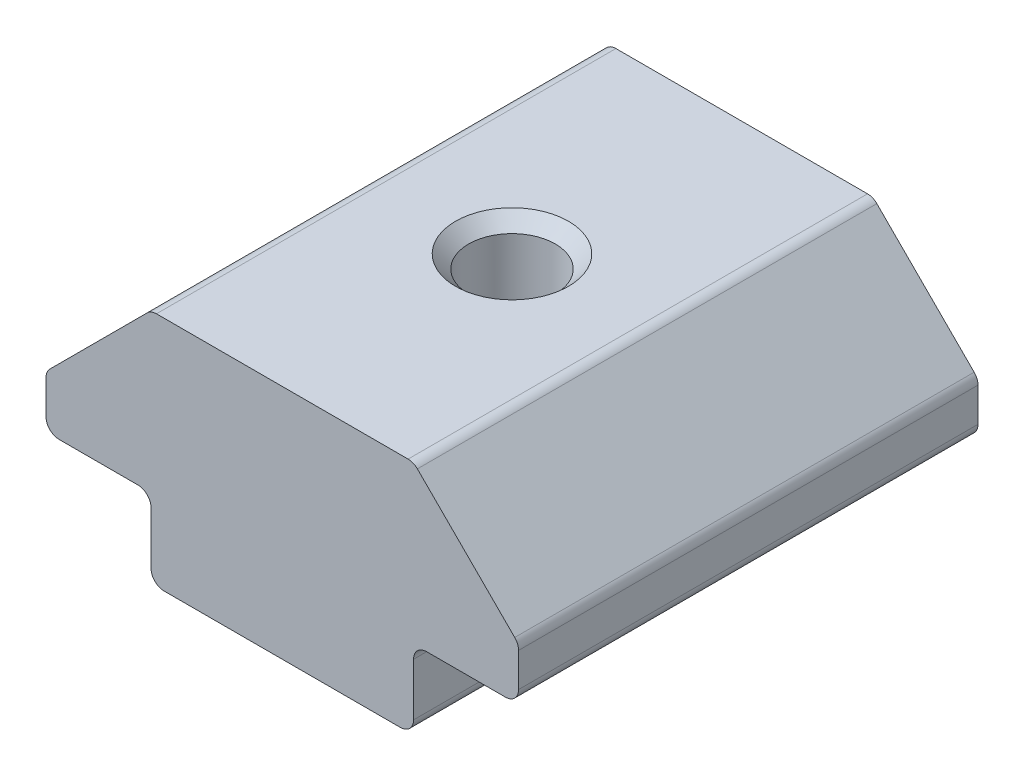
ISO-10303-21;
HEADER;
FILE_DESCRIPTION(('STEP AP214'),'2;1');
FILE_NAME('part.step','',(''),(''),'','','');
FILE_SCHEMA(('AUTOMOTIVE_DESIGN { 1 0 10303 214 1 1 1 1 }'));
ENDSEC;
DATA;
#1=APPLICATION_CONTEXT('core data for automotive mechanical design processes');
#2=APPLICATION_PROTOCOL_DEFINITION('international standard','automotive_design',2000,#1);
#3=PRODUCT_CONTEXT('',#1,'mechanical');
#4=PRODUCT('Part','Part','',(#3));
#5=PRODUCT_RELATED_PRODUCT_CATEGORY('part','',(#4));
#6=PRODUCT_DEFINITION_FORMATION('','',#4);
#7=PRODUCT_DEFINITION_CONTEXT('part definition',#1,'design');
#8=PRODUCT_DEFINITION('design','',#6,#7);
#9=PRODUCT_DEFINITION_SHAPE('','',#8);
#10=(LENGTH_UNIT() NAMED_UNIT(*) SI_UNIT(.MILLI.,.METRE.));
#11=(NAMED_UNIT(*) PLANE_ANGLE_UNIT() SI_UNIT($,.RADIAN.));
#12=(NAMED_UNIT(*) SI_UNIT($,.STERADIAN.) SOLID_ANGLE_UNIT());
#13=UNCERTAINTY_MEASURE_WITH_UNIT(LENGTH_MEASURE(1.E-05),#10,'distance_accuracy_value','');
#14=(GEOMETRIC_REPRESENTATION_CONTEXT(3) GLOBAL_UNCERTAINTY_ASSIGNED_CONTEXT((#13)) GLOBAL_UNIT_ASSIGNED_CONTEXT((#10,
#11,#12)) REPRESENTATION_CONTEXT('',''));
#15=CARTESIAN_POINT('',(0.,0.,0.));
#16=DIRECTION('',(0.,0.,1.));
#17=DIRECTION('',(1.,0.,0.));
#18=AXIS2_PLACEMENT_3D('',#15,#16,#17);
#19=CARTESIAN_POINT('',(-6.63715847617141,0.189784071231771,8.69764901970257));
#20=DIRECTION('',(1.,0.,0.));
#21=DIRECTION('',(0.,0.,-1.));
#22=AXIS2_PLACEMENT_3D('',#19,#20,#21);
#23=PLANE('',#22);
#24=DIRECTION('',(0.,-1.,0.));
#25=VECTOR('',#24,1.);
#26=CARTESIAN_POINT('',(-6.63715847617141,0.189784071231771,8.69764901970257));
#27=LINE('',#26,#25);
#28=CARTESIAN_POINT('',(-6.63715847617141,-0.310215928768229,8.69764901970257));
#29=VERTEX_POINT('',#28);
#30=CARTESIAN_POINT('',(-6.63715847617141,-2.31021592876823,8.69764901970257));
#31=VERTEX_POINT('',#30);
#32=EDGE_CURVE('E204',#29,#31,#27,.T.);
#33=ORIENTED_EDGE('',*,*,#32,.F.);
#34=DIRECTION('',(0.,0.,-1.));
#35=VECTOR('',#34,1.);
#36=CARTESIAN_POINT('',(-6.63715847617141,-0.310215928768229,-8.80235098029743));
#37=LINE('',#36,#35);
#38=CARTESIAN_POINT('',(-6.63715847617141,-0.310215928768229,-8.80235098029743));
#39=VERTEX_POINT('',#38);
#40=EDGE_CURVE('E283',#29,#39,#37,.T.);
#41=ORIENTED_EDGE('',*,*,#40,.T.);
#42=DIRECTION('',(0.,-1.,0.));
#43=VECTOR('',#42,1.);
#44=CARTESIAN_POINT('',(-6.63715847617141,0.189784071231771,-8.80235098029743));
#45=LINE('',#44,#43);
#46=CARTESIAN_POINT('',(-6.63715847617141,-2.31021592876823,-8.80235098029743));
#47=VERTEX_POINT('',#46);
#48=EDGE_CURVE('E178',#39,#47,#45,.T.);
#49=ORIENTED_EDGE('',*,*,#48,.T.);
#50=DIRECTION('',(0.,0.,-1.));
#51=VECTOR('',#50,1.);
#52=CARTESIAN_POINT('',(-6.63715847617141,-2.31021592876823,8.69764901970257));
#53=LINE('',#52,#51);
#54=EDGE_CURVE('E160',#47,#31,#53,.F.);
#55=ORIENTED_EDGE('',*,*,#54,.T.);
#56=EDGE_LOOP('',(#33,#41,#49,#55));
#57=FACE_BOUND('',#56,.T.);
#58=ADVANCED_FACE('F16',(#57),#23,.F.);
#59=CARTESIAN_POINT('',(-6.63715847617141,-2.81021592876823,8.69764901970257));
#60=DIRECTION('',(0.,1.,0.));
#61=DIRECTION('',(0.,0.,1.));
#62=AXIS2_PLACEMENT_3D('',#59,#60,#61);
#63=PLANE('',#62);
#64=CARTESIAN_POINT('',(-1.63715847617141,-2.81021592876823,-0.0523509802974331));
#65=DIRECTION('',(0.,1.,0.));
#66=DIRECTION('',(0.,0.,1.));
#67=AXIS2_PLACEMENT_3D('',#64,#65,#66);
#68=CIRCLE('',#67,2.15);
#69=CARTESIAN_POINT('',(-1.63715847617141,-2.81021592876823,2.09764901970257));
#70=VERTEX_POINT('',#69);
#71=EDGE_CURVE('E271',#70,#70,#68,.T.);
#72=ORIENTED_EDGE('',*,*,#71,.T.);
#73=EDGE_LOOP('',(#72));
#74=FACE_BOUND('',#73,.T.);
#75=DIRECTION('',(1.,0.,0.));
#76=VECTOR('',#75,1.);
#77=CARTESIAN_POINT('',(-6.63715847617141,-2.81021592876823,8.69764901970257));
#78=LINE('',#77,#76);
#79=CARTESIAN_POINT('',(-6.13715847617141,-2.81021592876823,8.69764901970257));
#80=VERTEX_POINT('',#79);
#81=CARTESIAN_POINT('',(2.86284152382859,-2.81021592876823,8.69764901970257));
#82=VERTEX_POINT('',#81);
#83=EDGE_CURVE('E172',#80,#82,#78,.T.);
#84=ORIENTED_EDGE('',*,*,#83,.F.);
#85=DIRECTION('',(0.,0.,-1.));
#86=VECTOR('',#85,1.);
#87=CARTESIAN_POINT('',(-6.13715847617141,-2.81021592876823,8.69764901970257));
#88=LINE('',#87,#86);
#89=CARTESIAN_POINT('',(-6.13715847617141,-2.81021592876823,-8.80235098029743));
#90=VERTEX_POINT('',#89);
#91=EDGE_CURVE('E158',#80,#90,#88,.T.);
#92=ORIENTED_EDGE('',*,*,#91,.T.);
#93=DIRECTION('',(1.,0.,0.));
#94=VECTOR('',#93,1.);
#95=CARTESIAN_POINT('',(-6.63715847617141,-2.81021592876823,-8.80235098029743));
#96=LINE('',#95,#94);
#97=CARTESIAN_POINT('',(2.86284152382859,-2.81021592876823,-8.80235098029743));
#98=VERTEX_POINT('',#97);
#99=EDGE_CURVE('E169',#90,#98,#96,.T.);
#100=ORIENTED_EDGE('',*,*,#99,.T.);
#101=DIRECTION('',(0.,0.,-1.));
#102=VECTOR('',#101,1.);
#103=CARTESIAN_POINT('',(2.86284152382859,-2.81021592876823,8.69764901970257));
#104=LINE('',#103,#102);
#105=EDGE_CURVE('E174',#98,#82,#104,.F.);
#106=ORIENTED_EDGE('',*,*,#105,.T.);
#107=EDGE_LOOP('',(#84,#92,#100,#106));
#108=FACE_BOUND('',#107,.T.);
#109=ADVANCED_FACE('F168',(#74,#108),#63,.F.);
#110=CARTESIAN_POINT('',(3.36284152382859,-2.81021592876823,8.69764901970257));
#111=DIRECTION('',(-1.,0.,0.));
#112=DIRECTION('',(0.,0.,1.));
#113=AXIS2_PLACEMENT_3D('',#110,#111,#112);
#114=PLANE('',#113);
#115=DIRECTION('',(0.,1.,0.));
#116=VECTOR('',#115,1.);
#117=CARTESIAN_POINT('',(3.36284152382859,-2.81021592876823,-8.80235098029743));
#118=LINE('',#117,#116);
#119=CARTESIAN_POINT('',(3.36284152382859,-2.31021592876823,-8.80235098029743));
#120=VERTEX_POINT('',#119);
#121=CARTESIAN_POINT('',(3.36284152382859,-0.310215928768229,-8.80235098029743));
#122=VERTEX_POINT('',#121);
#123=EDGE_CURVE('E177',#120,#122,#118,.T.);
#124=ORIENTED_EDGE('',*,*,#123,.T.);
#125=DIRECTION('',(0.,0.,-1.));
#126=VECTOR('',#125,1.);
#127=CARTESIAN_POINT('',(3.36284152382859,-0.310215928768229,8.69764901970257));
#128=LINE('',#127,#126);
#129=CARTESIAN_POINT('',(3.36284152382859,-0.310215928768229,8.69764901970257));
#130=VERTEX_POINT('',#129);
#131=EDGE_CURVE('E37',#122,#130,#128,.F.);
#132=ORIENTED_EDGE('',*,*,#131,.T.);
#133=DIRECTION('',(0.,1.,0.));
#134=VECTOR('',#133,1.);
#135=CARTESIAN_POINT('',(3.36284152382859,-2.81021592876823,8.69764901970257));
#136=LINE('',#135,#134);
#137=CARTESIAN_POINT('',(3.36284152382859,-2.31021592876823,8.69764901970257));
#138=VERTEX_POINT('',#137);
#139=EDGE_CURVE('E377',#138,#130,#136,.T.);
#140=ORIENTED_EDGE('',*,*,#139,.F.);
#141=DIRECTION('',(0.,0.,-1.));
#142=VECTOR('',#141,1.);
#143=CARTESIAN_POINT('',(3.36284152382859,-2.31021592876823,8.69764901970257));
#144=LINE('',#143,#142);
#145=EDGE_CURVE('E268',#138,#120,#144,.T.);
#146=ORIENTED_EDGE('',*,*,#145,.T.);
#147=EDGE_LOOP('',(#124,#132,#140,#146));
#148=FACE_BOUND('',#147,.T.);
#149=ADVANCED_FACE('F390',(#148),#114,.F.);
#150=CARTESIAN_POINT('',(3.36284152382859,0.189784071231771,8.69764901970257));
#151=DIRECTION('',(0.,1.,0.));
#152=DIRECTION('',(0.,0.,1.));
#153=AXIS2_PLACEMENT_3D('',#150,#151,#152);
#154=PLANE('',#153);
#155=DIRECTION('',(1.,0.,0.));
#156=VECTOR('',#155,1.);
#157=CARTESIAN_POINT('',(3.36284152382859,0.189784071231771,8.69764901970257));
#158=LINE('',#157,#156);
#159=CARTESIAN_POINT('',(3.86284152382859,0.189784071231771,8.69764901970257));
#160=VERTEX_POINT('',#159);
#161=CARTESIAN_POINT('',(6.86284152382859,0.189784071231771,8.69764901970257));
#162=VERTEX_POINT('',#161);
#163=EDGE_CURVE('E374',#160,#162,#158,.T.);
#164=ORIENTED_EDGE('',*,*,#163,.F.);
#165=DIRECTION('',(0.,0.,-1.));
#166=VECTOR('',#165,1.);
#167=CARTESIAN_POINT('',(3.86284152382859,0.189784071231771,-8.80235098029743));
#168=LINE('',#167,#166);
#169=CARTESIAN_POINT('',(3.86284152382859,0.189784071231771,-8.80235098029743));
#170=VERTEX_POINT('',#169);
#171=EDGE_CURVE('E288',#160,#170,#168,.T.);
#172=ORIENTED_EDGE('',*,*,#171,.T.);
#173=DIRECTION('',(1.,0.,0.));
#174=VECTOR('',#173,1.);
#175=CARTESIAN_POINT('',(3.36284152382859,0.189784071231771,-8.80235098029743));
#176=LINE('',#175,#174);
#177=CARTESIAN_POINT('',(6.86284152382859,0.189784071231771,-8.80235098029743));
#178=VERTEX_POINT('',#177);
#179=EDGE_CURVE('E180',#170,#178,#176,.T.);
#180=ORIENTED_EDGE('',*,*,#179,.T.);
#181=DIRECTION('',(0.,0.,-1.));
#182=VECTOR('',#181,1.);
#183=CARTESIAN_POINT('',(6.86284152382859,0.189784071231771,8.69764901970257));
#184=LINE('',#183,#182);
#185=EDGE_CURVE('E265',#178,#162,#184,.F.);
#186=ORIENTED_EDGE('',*,*,#185,.T.);
#187=EDGE_LOOP('',(#164,#172,#180,#186));
#188=FACE_BOUND('',#187,.T.);
#189=ADVANCED_FACE('F372',(#188),#154,.F.);
#190=CARTESIAN_POINT('',(7.36284152382859,0.189784071231771,8.69764901970257));
#191=DIRECTION('',(-1.,0.,0.));
#192=DIRECTION('',(0.,0.,1.));
#193=AXIS2_PLACEMENT_3D('',#190,#191,#192);
#194=PLANE('',#193);
#195=DIRECTION('',(0.,1.,0.));
#196=VECTOR('',#195,1.);
#197=CARTESIAN_POINT('',(7.36284152382859,0.189784071231771,-8.80235098029743));
#198=LINE('',#197,#196);
#199=CARTESIAN_POINT('',(7.36284152382859,0.689784071231772,-8.80235098029743));
#200=VERTEX_POINT('',#199);
#201=CARTESIAN_POINT('',(7.36284152382859,1.98267729004524,-8.80235098029743));
#202=VERTEX_POINT('',#201);
#203=EDGE_CURVE('E186',#200,#202,#198,.T.);
#204=ORIENTED_EDGE('',*,*,#203,.T.);
#205=DIRECTION('',(0.,0.,-1.));
#206=VECTOR('',#205,1.);
#207=CARTESIAN_POINT('',(7.36284152382859,1.98267729004524,8.69764901970257));
#208=LINE('',#207,#206);
#209=CARTESIAN_POINT('',(7.36284152382859,1.98267729004524,8.69764901970257));
#210=VERTEX_POINT('',#209);
#211=EDGE_CURVE('E263',#202,#210,#208,.F.);
#212=ORIENTED_EDGE('',*,*,#211,.T.);
#213=DIRECTION('',(0.,1.,0.));
#214=VECTOR('',#213,1.);
#215=CARTESIAN_POINT('',(7.36284152382859,0.189784071231771,8.69764901970257));
#216=LINE('',#215,#214);
#217=CARTESIAN_POINT('',(7.36284152382859,0.689784071231772,8.69764901970257));
#218=VERTEX_POINT('',#217);
#219=EDGE_CURVE('E365',#218,#210,#216,.T.);
#220=ORIENTED_EDGE('',*,*,#219,.F.);
#221=DIRECTION('',(0.,0.,-1.));
#222=VECTOR('',#221,1.);
#223=CARTESIAN_POINT('',(7.36284152382859,0.689784071231772,8.69764901970257));
#224=LINE('',#223,#222);
#225=EDGE_CURVE('E260',#218,#200,#224,.T.);
#226=ORIENTED_EDGE('',*,*,#225,.T.);
#227=EDGE_LOOP('',(#204,#212,#220,#226));
#228=FACE_BOUND('',#227,.T.);
#229=ADVANCED_FACE('F361',(#228),#194,.F.);
#230=CARTESIAN_POINT('',(7.36284152382859,2.18978407123179,8.69764901970257));
#231=DIRECTION('',(-0.707106781186546,-0.707106781186549,0.));
#232=DIRECTION('',(0.707106781186549,-0.707106781186546,0.));
#233=AXIS2_PLACEMENT_3D('',#230,#231,#232);
#234=PLANE('',#233);
#235=DIRECTION('',(-0.707106781186549,0.707106781186546,0.));
#236=VECTOR('',#235,1.);
#237=CARTESIAN_POINT('',(7.36284152382859,2.18978407123179,-8.80235098029743));
#238=LINE('',#237,#236);
#239=CARTESIAN_POINT('',(7.21639491442186,2.33623068063851,-8.80235098029743));
#240=VERTEX_POINT('',#239);
#241=CARTESIAN_POINT('',(3.50928813323532,6.04333746182504,-8.80235098029743));
#242=VERTEX_POINT('',#241);
#243=EDGE_CURVE('E189',#240,#242,#238,.T.);
#244=ORIENTED_EDGE('',*,*,#243,.T.);
#245=DIRECTION('',(0.,0.,-1.));
#246=VECTOR('',#245,1.);
#247=CARTESIAN_POINT('',(3.50928813323532,6.04333746182504,8.69764901970257));
#248=LINE('',#247,#246);
#249=CARTESIAN_POINT('',(3.50928813323532,6.04333746182504,8.69764901970257));
#250=VERTEX_POINT('',#249);
#251=EDGE_CURVE('E258',#242,#250,#248,.F.);
#252=ORIENTED_EDGE('',*,*,#251,.T.);
#253=DIRECTION('',(-0.707106781186549,0.707106781186546,0.));
#254=VECTOR('',#253,1.);
#255=CARTESIAN_POINT('',(7.36284152382859,2.18978407123179,8.69764901970257));
#256=LINE('',#255,#254);
#257=CARTESIAN_POINT('',(7.21639491442186,2.33623068063851,8.69764901970257));
#258=VERTEX_POINT('',#257);
#259=EDGE_CURVE('E354',#258,#250,#256,.T.);
#260=ORIENTED_EDGE('',*,*,#259,.F.);
#261=DIRECTION('',(0.,0.,-1.));
#262=VECTOR('',#261,1.);
#263=CARTESIAN_POINT('',(7.21639491442186,2.33623068063851,8.69764901970257));
#264=LINE('',#263,#262);
#265=EDGE_CURVE('E255',#258,#240,#264,.T.);
#266=ORIENTED_EDGE('',*,*,#265,.T.);
#267=EDGE_LOOP('',(#244,#252,#260,#266));
#268=FACE_BOUND('',#267,.T.);
#269=ADVANCED_FACE('F350',(#268),#234,.F.);
#270=CARTESIAN_POINT('',(3.36284152382859,6.18978407123177,8.69764901970257));
#271=DIRECTION('',(0.,-1.,0.));
#272=DIRECTION('',(0.,0.,-1.));
#273=AXIS2_PLACEMENT_3D('',#270,#271,#272);
#274=PLANE('',#273);
#275=CARTESIAN_POINT('',(-1.63715847617141,6.18978407123177,-0.0523509802974331));
#276=DIRECTION('',(0.,-1.,0.));
#277=DIRECTION('',(0.,0.,-1.));
#278=AXIS2_PLACEMENT_3D('',#275,#276,#277);
#279=CIRCLE('',#278,2.15000000000001);
#280=CARTESIAN_POINT('',(-1.63715847617141,6.18978407123177,-2.20235098029744));
#281=VERTEX_POINT('',#280);
#282=EDGE_CURVE('E280',#281,#281,#279,.T.);
#283=ORIENTED_EDGE('',*,*,#282,.T.);
#284=EDGE_LOOP('',(#283));
#285=FACE_BOUND('',#284,.T.);
#286=DIRECTION('',(-1.,0.,0.));
#287=VECTOR('',#286,1.);
#288=CARTESIAN_POINT('',(3.36284152382859,6.18978407123177,-8.80235098029743));
#289=LINE('',#288,#287);
#290=CARTESIAN_POINT('',(3.15573474264205,6.18978407123177,-8.80235098029743));
#291=VERTEX_POINT('',#290);
#292=CARTESIAN_POINT('',(-6.43005169498486,6.18978407123177,-8.80235098029743));
#293=VERTEX_POINT('',#292);
#294=EDGE_CURVE('E192',#291,#293,#289,.T.);
#295=ORIENTED_EDGE('',*,*,#294,.T.);
#296=DIRECTION('',(0.,0.,-1.));
#297=VECTOR('',#296,1.);
#298=CARTESIAN_POINT('',(-6.43005169498486,6.18978407123177,8.69764901970257));
#299=LINE('',#298,#297);
#300=CARTESIAN_POINT('',(-6.43005169498486,6.18978407123177,8.69764901970257));
#301=VERTEX_POINT('',#300);
#302=EDGE_CURVE('E253',#293,#301,#299,.F.);
#303=ORIENTED_EDGE('',*,*,#302,.T.);
#304=DIRECTION('',(-1.,0.,0.));
#305=VECTOR('',#304,1.);
#306=CARTESIAN_POINT('',(3.36284152382859,6.18978407123177,8.69764901970257));
#307=LINE('',#306,#305);
#308=CARTESIAN_POINT('',(3.15573474264205,6.18978407123177,8.69764901970257));
#309=VERTEX_POINT('',#308);
#310=EDGE_CURVE('E343',#309,#301,#307,.T.);
#311=ORIENTED_EDGE('',*,*,#310,.F.);
#312=DIRECTION('',(0.,0.,-1.));
#313=VECTOR('',#312,1.);
#314=CARTESIAN_POINT('',(3.15573474264205,6.18978407123177,8.69764901970257));
#315=LINE('',#314,#313);
#316=EDGE_CURVE('E250',#309,#291,#315,.T.);
#317=ORIENTED_EDGE('',*,*,#316,.T.);
#318=EDGE_LOOP('',(#295,#303,#311,#317));
#319=FACE_BOUND('',#318,.T.);
#320=ADVANCED_FACE('F339',(#285,#319),#274,.F.);
#321=CARTESIAN_POINT('',(-10.6371584761714,2.18978407123178,8.69764901970257));
#322=DIRECTION('',(0.707106781186546,-0.707106781186549,0.));
#323=DIRECTION('',(0.707106781186549,0.707106781186546,0.));
#324=AXIS2_PLACEMENT_3D('',#321,#322,#323);
#325=PLANE('',#324);
#326=DIRECTION('',(-0.707106781186549,-0.707106781186546,0.));
#327=VECTOR('',#326,1.);
#328=CARTESIAN_POINT('',(-10.6371584761714,2.18978407123178,-8.80235098029743));
#329=LINE('',#328,#327);
#330=CARTESIAN_POINT('',(-6.78360508557813,6.04333746182504,-8.80235098029743));
#331=VERTEX_POINT('',#330);
#332=CARTESIAN_POINT('',(-10.4907118667647,2.33623068063851,-8.80235098029743));
#333=VERTEX_POINT('',#332);
#334=EDGE_CURVE('E195',#331,#333,#329,.T.);
#335=ORIENTED_EDGE('',*,*,#334,.T.);
#336=DIRECTION('',(0.,0.,-1.));
#337=VECTOR('',#336,1.);
#338=CARTESIAN_POINT('',(-10.4907118667647,2.33623068063851,8.69764901970257));
#339=LINE('',#338,#337);
#340=CARTESIAN_POINT('',(-10.4907118667647,2.33623068063851,8.69764901970257));
#341=VERTEX_POINT('',#340);
#342=EDGE_CURVE('E248',#333,#341,#339,.F.);
#343=ORIENTED_EDGE('',*,*,#342,.T.);
#344=DIRECTION('',(-0.707106781186549,-0.707106781186546,0.));
#345=VECTOR('',#344,1.);
#346=CARTESIAN_POINT('',(-10.6371584761714,2.18978407123178,8.69764901970257));
#347=LINE('',#346,#345);
#348=CARTESIAN_POINT('',(-6.78360508557813,6.04333746182504,8.69764901970257));
#349=VERTEX_POINT('',#348);
#350=EDGE_CURVE('E332',#349,#341,#347,.T.);
#351=ORIENTED_EDGE('',*,*,#350,.F.);
#352=DIRECTION('',(0.,0.,-1.));
#353=VECTOR('',#352,1.);
#354=CARTESIAN_POINT('',(-6.78360508557813,6.04333746182504,8.69764901970257));
#355=LINE('',#354,#353);
#356=EDGE_CURVE('E245',#349,#331,#355,.T.);
#357=ORIENTED_EDGE('',*,*,#356,.T.);
#358=EDGE_LOOP('',(#335,#343,#351,#357));
#359=FACE_BOUND('',#358,.T.);
#360=ADVANCED_FACE('F328',(#359),#325,.F.);
#361=CARTESIAN_POINT('',(-10.6371584761714,0.189784071231771,8.69764901970257));
#362=DIRECTION('',(1.,0.,0.));
#363=DIRECTION('',(0.,0.,-1.));
#364=AXIS2_PLACEMENT_3D('',#361,#362,#363);
#365=PLANE('',#364);
#366=DIRECTION('',(0.,-1.,0.));
#367=VECTOR('',#366,1.);
#368=CARTESIAN_POINT('',(-10.6371584761714,0.189784071231771,-8.80235098029743));
#369=LINE('',#368,#367);
#370=CARTESIAN_POINT('',(-10.6371584761714,1.98267729004524,-8.80235098029743));
#371=VERTEX_POINT('',#370);
#372=CARTESIAN_POINT('',(-10.6371584761714,0.689784071231772,-8.80235098029743));
#373=VERTEX_POINT('',#372);
#374=EDGE_CURVE('E198',#371,#373,#369,.T.);
#375=ORIENTED_EDGE('',*,*,#374,.T.);
#376=DIRECTION('',(0.,0.,-1.));
#377=VECTOR('',#376,1.);
#378=CARTESIAN_POINT('',(-10.6371584761714,0.689784071231772,8.69764901970257));
#379=LINE('',#378,#377);
#380=CARTESIAN_POINT('',(-10.6371584761714,0.689784071231772,8.69764901970257));
#381=VERTEX_POINT('',#380);
#382=EDGE_CURVE('E243',#373,#381,#379,.F.);
#383=ORIENTED_EDGE('',*,*,#382,.T.);
#384=DIRECTION('',(0.,-1.,0.));
#385=VECTOR('',#384,1.);
#386=CARTESIAN_POINT('',(-10.6371584761714,0.189784071231771,8.69764901970257));
#387=LINE('',#386,#385);
#388=CARTESIAN_POINT('',(-10.6371584761714,1.98267729004524,8.69764901970257));
#389=VERTEX_POINT('',#388);
#390=EDGE_CURVE('E321',#389,#381,#387,.T.);
#391=ORIENTED_EDGE('',*,*,#390,.F.);
#392=DIRECTION('',(0.,0.,-1.));
#393=VECTOR('',#392,1.);
#394=CARTESIAN_POINT('',(-10.6371584761714,1.98267729004524,8.69764901970257));
#395=LINE('',#394,#393);
#396=EDGE_CURVE('E240',#389,#371,#395,.T.);
#397=ORIENTED_EDGE('',*,*,#396,.T.);
#398=EDGE_LOOP('',(#375,#383,#391,#397));
#399=FACE_BOUND('',#398,.T.);
#400=ADVANCED_FACE('F317',(#399),#365,.F.);
#401=CARTESIAN_POINT('',(-10.6371584761714,0.189784071231771,8.69764901970257));
#402=DIRECTION('',(0.,1.,0.));
#403=DIRECTION('',(0.,0.,1.));
#404=AXIS2_PLACEMENT_3D('',#401,#402,#403);
#405=PLANE('',#404);
#406=DIRECTION('',(1.,0.,0.));
#407=VECTOR('',#406,1.);
#408=CARTESIAN_POINT('',(-10.6371584761714,0.189784071231771,-8.80235098029743));
#409=LINE('',#408,#407);
#410=CARTESIAN_POINT('',(-10.1371584761714,0.189784071231771,-8.80235098029743));
#411=VERTEX_POINT('',#410);
#412=CARTESIAN_POINT('',(-7.13715847617141,0.189784071231771,-8.80235098029743));
#413=VERTEX_POINT('',#412);
#414=EDGE_CURVE('E201',#411,#413,#409,.T.);
#415=ORIENTED_EDGE('',*,*,#414,.T.);
#416=DIRECTION('',(0.,0.,-1.));
#417=VECTOR('',#416,1.);
#418=CARTESIAN_POINT('',(-7.13715847617141,0.189784071231771,8.69764901970257));
#419=LINE('',#418,#417);
#420=CARTESIAN_POINT('',(-7.13715847617141,0.189784071231771,8.69764901970257));
#421=VERTEX_POINT('',#420);
#422=EDGE_CURVE('E286',#413,#421,#419,.F.);
#423=ORIENTED_EDGE('',*,*,#422,.T.);
#424=DIRECTION('',(1.,0.,0.));
#425=VECTOR('',#424,1.);
#426=CARTESIAN_POINT('',(-10.6371584761714,0.189784071231771,8.69764901970257));
#427=LINE('',#426,#425);
#428=CARTESIAN_POINT('',(-10.1371584761714,0.189784071231771,8.69764901970257));
#429=VERTEX_POINT('',#428);
#430=EDGE_CURVE('E205',#429,#421,#427,.T.);
#431=ORIENTED_EDGE('',*,*,#430,.F.);
#432=DIRECTION('',(0.,0.,-1.));
#433=VECTOR('',#432,1.);
#434=CARTESIAN_POINT('',(-10.1371584761714,0.189784071231771,8.69764901970257));
#435=LINE('',#434,#433);
#436=EDGE_CURVE('E237',#429,#411,#435,.T.);
#437=ORIENTED_EDGE('',*,*,#436,.T.);
#438=EDGE_LOOP('',(#415,#423,#431,#437));
#439=FACE_BOUND('',#438,.T.);
#440=ADVANCED_FACE('F309',(#439),#405,.F.);
#441=CARTESIAN_POINT('',(-1.63715847617141,-2.81021592876823,8.69764901970257));
#442=DIRECTION('',(0.,0.,1.));
#443=DIRECTION('',(1.,0.,0.));
#444=AXIS2_PLACEMENT_3D('',#441,#442,#443);
#445=PLANE('',#444);
#446=ORIENTED_EDGE('',*,*,#430,.T.);
#447=CARTESIAN_POINT('',(-7.13715847617141,-0.310215928768229,8.69764901970257));
#448=DIRECTION('',(0.,0.,1.));
#449=DIRECTION('',(1.,0.,0.));
#450=AXIS2_PLACEMENT_3D('',#447,#448,#449);
#451=CIRCLE('',#450,0.5);
#452=EDGE_CURVE('E294',#421,#29,#451,.F.);
#453=ORIENTED_EDGE('',*,*,#452,.T.);
#454=ORIENTED_EDGE('',*,*,#32,.T.);
#455=CARTESIAN_POINT('',(-6.13715847617141,-2.31021592876823,8.69764901970257));
#456=DIRECTION('',(0.,0.,1.));
#457=DIRECTION('',(1.,0.,0.));
#458=AXIS2_PLACEMENT_3D('',#455,#456,#457);
#459=CIRCLE('',#458,0.5);
#460=EDGE_CURVE('E235',#31,#80,#459,.T.);
#461=ORIENTED_EDGE('',*,*,#460,.T.);
#462=ORIENTED_EDGE('',*,*,#83,.T.);
#463=CARTESIAN_POINT('',(2.86284152382859,-2.31021592876823,8.69764901970257));
#464=DIRECTION('',(0.,0.,1.));
#465=DIRECTION('',(1.,0.,0.));
#466=AXIS2_PLACEMENT_3D('',#463,#464,#465);
#467=CIRCLE('',#466,0.5);
#468=EDGE_CURVE('E221',#82,#138,#467,.T.);
#469=ORIENTED_EDGE('',*,*,#468,.T.);
#470=ORIENTED_EDGE('',*,*,#139,.T.);
#471=CARTESIAN_POINT('',(3.86284152382859,-0.310215928768229,8.69764901970257));
#472=DIRECTION('',(0.,0.,1.));
#473=DIRECTION('',(1.,0.,0.));
#474=AXIS2_PLACEMENT_3D('',#471,#472,#473);
#475=CIRCLE('',#474,0.5);
#476=EDGE_CURVE('E10',#130,#160,#475,.F.);
#477=ORIENTED_EDGE('',*,*,#476,.T.);
#478=ORIENTED_EDGE('',*,*,#163,.T.);
#479=CARTESIAN_POINT('',(6.86284152382859,0.689784071231772,8.69764901970257));
#480=DIRECTION('',(0.,0.,1.));
#481=DIRECTION('',(1.,0.,0.));
#482=AXIS2_PLACEMENT_3D('',#479,#480,#481);
#483=CIRCLE('',#482,0.5);
#484=EDGE_CURVE('E223',#162,#218,#483,.T.);
#485=ORIENTED_EDGE('',*,*,#484,.T.);
#486=ORIENTED_EDGE('',*,*,#219,.T.);
#487=CARTESIAN_POINT('',(6.86284152382859,1.98267729004524,8.69764901970257));
#488=DIRECTION('',(0.,0.,1.));
#489=DIRECTION('',(1.,0.,0.));
#490=AXIS2_PLACEMENT_3D('',#487,#488,#489);
#491=CIRCLE('',#490,0.5);
#492=EDGE_CURVE('E225',#210,#258,#491,.T.);
#493=ORIENTED_EDGE('',*,*,#492,.T.);
#494=ORIENTED_EDGE('',*,*,#259,.T.);
#495=CARTESIAN_POINT('',(3.15573474264205,5.68978407123177,8.69764901970257));
#496=DIRECTION('',(0.,0.,1.));
#497=DIRECTION('',(1.,0.,0.));
#498=AXIS2_PLACEMENT_3D('',#495,#496,#497);
#499=CIRCLE('',#498,0.5);
#500=EDGE_CURVE('E227',#250,#309,#499,.T.);
#501=ORIENTED_EDGE('',*,*,#500,.T.);
#502=ORIENTED_EDGE('',*,*,#310,.T.);
#503=CARTESIAN_POINT('',(-6.43005169498486,5.68978407123177,8.69764901970257));
#504=DIRECTION('',(0.,0.,1.));
#505=DIRECTION('',(1.,0.,0.));
#506=AXIS2_PLACEMENT_3D('',#503,#504,#505);
#507=CIRCLE('',#506,0.5);
#508=EDGE_CURVE('E229',#301,#349,#507,.T.);
#509=ORIENTED_EDGE('',*,*,#508,.T.);
#510=ORIENTED_EDGE('',*,*,#350,.T.);
#511=CARTESIAN_POINT('',(-10.1371584761714,1.98267729004524,8.69764901970257));
#512=DIRECTION('',(0.,0.,1.));
#513=DIRECTION('',(1.,0.,0.));
#514=AXIS2_PLACEMENT_3D('',#511,#512,#513);
#515=CIRCLE('',#514,0.5);
#516=EDGE_CURVE('E231',#341,#389,#515,.T.);
#517=ORIENTED_EDGE('',*,*,#516,.T.);
#518=ORIENTED_EDGE('',*,*,#390,.T.);
#519=CARTESIAN_POINT('',(-10.1371584761714,0.689784071231772,8.69764901970257));
#520=DIRECTION('',(0.,0.,1.));
#521=DIRECTION('',(1.,0.,0.));
#522=AXIS2_PLACEMENT_3D('',#519,#520,#521);
#523=CIRCLE('',#522,0.5);
#524=EDGE_CURVE('E233',#381,#429,#523,.T.);
#525=ORIENTED_EDGE('',*,*,#524,.T.);
#526=EDGE_LOOP('',(#446,#453,#454,#461,#462,#469,#470,#477,#478,#485,#486,#493,#494,#501,#502,
#509,#510,#517,#518,#525));
#527=FACE_BOUND('',#526,.T.);
#528=ADVANCED_FACE('F299',(#527),#445,.T.);
#529=CARTESIAN_POINT('',(-1.63715847617141,-2.81021592876823,-8.80235098029743));
#530=DIRECTION('',(0.,0.,1.));
#531=DIRECTION('',(1.,0.,0.));
#532=AXIS2_PLACEMENT_3D('',#529,#530,#531);
#533=PLANE('',#532);
#534=ORIENTED_EDGE('',*,*,#99,.F.);
#535=CARTESIAN_POINT('',(-6.13715847617141,-2.31021592876823,-8.80235098029743));
#536=DIRECTION('',(0.,0.,1.));
#537=DIRECTION('',(1.,0.,0.));
#538=AXIS2_PLACEMENT_3D('',#535,#536,#537);
#539=CIRCLE('',#538,0.5);
#540=EDGE_CURVE('E154',#90,#47,#539,.F.);
#541=ORIENTED_EDGE('',*,*,#540,.T.);
#542=ORIENTED_EDGE('',*,*,#48,.F.);
#543=CARTESIAN_POINT('',(-7.13715847617141,-0.310215928768229,-8.80235098029743));
#544=DIRECTION('',(0.,0.,1.));
#545=DIRECTION('',(1.,0.,0.));
#546=AXIS2_PLACEMENT_3D('',#543,#544,#545);
#547=CIRCLE('',#546,0.5);
#548=EDGE_CURVE('E292',#39,#413,#547,.T.);
#549=ORIENTED_EDGE('',*,*,#548,.T.);
#550=ORIENTED_EDGE('',*,*,#414,.F.);
#551=CARTESIAN_POINT('',(-10.1371584761714,0.689784071231772,-8.80235098029743));
#552=DIRECTION('',(0.,0.,1.));
#553=DIRECTION('',(1.,0.,0.));
#554=AXIS2_PLACEMENT_3D('',#551,#552,#553);
#555=CIRCLE('',#554,0.5);
#556=EDGE_CURVE('E163',#411,#373,#555,.F.);
#557=ORIENTED_EDGE('',*,*,#556,.T.);
#558=ORIENTED_EDGE('',*,*,#374,.F.);
#559=CARTESIAN_POINT('',(-10.1371584761714,1.98267729004524,-8.80235098029743));
#560=DIRECTION('',(0.,0.,1.));
#561=DIRECTION('',(1.,0.,0.));
#562=AXIS2_PLACEMENT_3D('',#559,#560,#561);
#563=CIRCLE('',#562,0.5);
#564=EDGE_CURVE('E217',#371,#333,#563,.F.);
#565=ORIENTED_EDGE('',*,*,#564,.T.);
#566=ORIENTED_EDGE('',*,*,#334,.F.);
#567=CARTESIAN_POINT('',(-6.43005169498486,5.68978407123177,-8.80235098029743));
#568=DIRECTION('',(0.,0.,1.));
#569=DIRECTION('',(1.,0.,0.));
#570=AXIS2_PLACEMENT_3D('',#567,#568,#569);
#571=CIRCLE('',#570,0.5);
#572=EDGE_CURVE('E215',#331,#293,#571,.F.);
#573=ORIENTED_EDGE('',*,*,#572,.T.);
#574=ORIENTED_EDGE('',*,*,#294,.F.);
#575=CARTESIAN_POINT('',(3.15573474264205,5.68978407123177,-8.80235098029743));
#576=DIRECTION('',(0.,0.,1.));
#577=DIRECTION('',(1.,0.,0.));
#578=AXIS2_PLACEMENT_3D('',#575,#576,#577);
#579=CIRCLE('',#578,0.5);
#580=EDGE_CURVE('E213',#291,#242,#579,.F.);
#581=ORIENTED_EDGE('',*,*,#580,.T.);
#582=ORIENTED_EDGE('',*,*,#243,.F.);
#583=CARTESIAN_POINT('',(6.86284152382859,1.98267729004524,-8.80235098029743));
#584=DIRECTION('',(0.,0.,1.));
#585=DIRECTION('',(1.,0.,0.));
#586=AXIS2_PLACEMENT_3D('',#583,#584,#585);
#587=CIRCLE('',#586,0.5);
#588=EDGE_CURVE('E211',#240,#202,#587,.F.);
#589=ORIENTED_EDGE('',*,*,#588,.T.);
#590=ORIENTED_EDGE('',*,*,#203,.F.);
#591=CARTESIAN_POINT('',(6.86284152382859,0.689784071231772,-8.80235098029743));
#592=DIRECTION('',(0.,0.,1.));
#593=DIRECTION('',(1.,0.,0.));
#594=AXIS2_PLACEMENT_3D('',#591,#592,#593);
#595=CIRCLE('',#594,0.5);
#596=EDGE_CURVE('E208',#200,#178,#595,.F.);
#597=ORIENTED_EDGE('',*,*,#596,.T.);
#598=ORIENTED_EDGE('',*,*,#179,.F.);
#599=CARTESIAN_POINT('',(3.86284152382859,-0.310215928768229,-8.80235098029743));
#600=DIRECTION('',(0.,0.,1.));
#601=DIRECTION('',(1.,0.,0.));
#602=AXIS2_PLACEMENT_3D('',#599,#600,#601);
#603=CIRCLE('',#602,0.5);
#604=EDGE_CURVE('E24',#170,#122,#603,.T.);
#605=ORIENTED_EDGE('',*,*,#604,.T.);
#606=ORIENTED_EDGE('',*,*,#123,.F.);
#607=CARTESIAN_POINT('',(2.86284152382859,-2.31021592876823,-8.80235098029743));
#608=DIRECTION('',(0.,0.,1.));
#609=DIRECTION('',(1.,0.,0.));
#610=AXIS2_PLACEMENT_3D('',#607,#608,#609);
#611=CIRCLE('',#610,0.5);
#612=EDGE_CURVE('E173',#120,#98,#611,.F.);
#613=ORIENTED_EDGE('',*,*,#612,.T.);
#614=EDGE_LOOP('',(#534,#541,#542,#549,#550,#557,#558,#565,#566,#573,#574,#581,#582,#589,#590,
#597,#598,#605,#606,#613));
#615=FACE_BOUND('',#614,.T.);
#616=ADVANCED_FACE('F176',(#615),#533,.F.);
#617=CARTESIAN_POINT('',(-6.13715847617141,-2.31021592876823,8.69764901970257));
#618=DIRECTION('',(0.,0.,-1.));
#619=DIRECTION('',(-1.,0.,0.));
#620=AXIS2_PLACEMENT_3D('',#617,#618,#619);
#621=CYLINDRICAL_SURFACE('',#620,0.5);
#622=ORIENTED_EDGE('',*,*,#460,.F.);
#623=ORIENTED_EDGE('',*,*,#54,.F.);
#624=ORIENTED_EDGE('',*,*,#540,.F.);
#625=ORIENTED_EDGE('',*,*,#91,.F.);
#626=EDGE_LOOP('',(#622,#623,#624,#625));
#627=FACE_BOUND('',#626,.T.);
#628=ADVANCED_FACE('F157',(#627),#621,.T.);
#629=CARTESIAN_POINT('',(-10.1371584761714,0.689784071231772,8.69764901970257));
#630=DIRECTION('',(0.,0.,-1.));
#631=DIRECTION('',(-1.,0.,0.));
#632=AXIS2_PLACEMENT_3D('',#629,#630,#631);
#633=CYLINDRICAL_SURFACE('',#632,0.5);
#634=ORIENTED_EDGE('',*,*,#524,.F.);
#635=ORIENTED_EDGE('',*,*,#382,.F.);
#636=ORIENTED_EDGE('',*,*,#556,.F.);
#637=ORIENTED_EDGE('',*,*,#436,.F.);
#638=EDGE_LOOP('',(#634,#635,#636,#637));
#639=FACE_BOUND('',#638,.T.);
#640=ADVANCED_FACE('F313',(#639),#633,.T.);
#641=CARTESIAN_POINT('',(-10.1371584761714,1.98267729004524,8.69764901970257));
#642=DIRECTION('',(0.,0.,-1.));
#643=DIRECTION('',(-1.,0.,0.));
#644=AXIS2_PLACEMENT_3D('',#641,#642,#643);
#645=CYLINDRICAL_SURFACE('',#644,0.5);
#646=ORIENTED_EDGE('',*,*,#516,.F.);
#647=ORIENTED_EDGE('',*,*,#342,.F.);
#648=ORIENTED_EDGE('',*,*,#564,.F.);
#649=ORIENTED_EDGE('',*,*,#396,.F.);
#650=EDGE_LOOP('',(#646,#647,#648,#649));
#651=FACE_BOUND('',#650,.T.);
#652=ADVANCED_FACE('F324',(#651),#645,.T.);
#653=CARTESIAN_POINT('',(-6.43005169498486,5.68978407123177,8.69764901970257));
#654=DIRECTION('',(0.,0.,-1.));
#655=DIRECTION('',(-1.,0.,0.));
#656=AXIS2_PLACEMENT_3D('',#653,#654,#655);
#657=CYLINDRICAL_SURFACE('',#656,0.5);
#658=ORIENTED_EDGE('',*,*,#508,.F.);
#659=ORIENTED_EDGE('',*,*,#302,.F.);
#660=ORIENTED_EDGE('',*,*,#572,.F.);
#661=ORIENTED_EDGE('',*,*,#356,.F.);
#662=EDGE_LOOP('',(#658,#659,#660,#661));
#663=FACE_BOUND('',#662,.T.);
#664=ADVANCED_FACE('F335',(#663),#657,.T.);
#665=CARTESIAN_POINT('',(3.15573474264205,5.68978407123177,8.69764901970257));
#666=DIRECTION('',(0.,0.,-1.));
#667=DIRECTION('',(-1.,0.,0.));
#668=AXIS2_PLACEMENT_3D('',#665,#666,#667);
#669=CYLINDRICAL_SURFACE('',#668,0.5);
#670=ORIENTED_EDGE('',*,*,#500,.F.);
#671=ORIENTED_EDGE('',*,*,#251,.F.);
#672=ORIENTED_EDGE('',*,*,#580,.F.);
#673=ORIENTED_EDGE('',*,*,#316,.F.);
#674=EDGE_LOOP('',(#670,#671,#672,#673));
#675=FACE_BOUND('',#674,.T.);
#676=ADVANCED_FACE('F346',(#675),#669,.T.);
#677=CARTESIAN_POINT('',(6.86284152382859,1.98267729004524,8.69764901970257));
#678=DIRECTION('',(0.,0.,-1.));
#679=DIRECTION('',(-1.,0.,0.));
#680=AXIS2_PLACEMENT_3D('',#677,#678,#679);
#681=CYLINDRICAL_SURFACE('',#680,0.5);
#682=ORIENTED_EDGE('',*,*,#492,.F.);
#683=ORIENTED_EDGE('',*,*,#211,.F.);
#684=ORIENTED_EDGE('',*,*,#588,.F.);
#685=ORIENTED_EDGE('',*,*,#265,.F.);
#686=EDGE_LOOP('',(#682,#683,#684,#685));
#687=FACE_BOUND('',#686,.T.);
#688=ADVANCED_FACE('F357',(#687),#681,.T.);
#689=CARTESIAN_POINT('',(6.86284152382859,0.689784071231772,8.69764901970257));
#690=DIRECTION('',(0.,0.,-1.));
#691=DIRECTION('',(-1.,0.,0.));
#692=AXIS2_PLACEMENT_3D('',#689,#690,#691);
#693=CYLINDRICAL_SURFACE('',#692,0.5);
#694=ORIENTED_EDGE('',*,*,#484,.F.);
#695=ORIENTED_EDGE('',*,*,#185,.F.);
#696=ORIENTED_EDGE('',*,*,#596,.F.);
#697=ORIENTED_EDGE('',*,*,#225,.F.);
#698=EDGE_LOOP('',(#694,#695,#696,#697));
#699=FACE_BOUND('',#698,.T.);
#700=ADVANCED_FACE('F368',(#699),#693,.T.);
#701=CARTESIAN_POINT('',(2.86284152382859,-2.31021592876823,8.69764901970257));
#702=DIRECTION('',(0.,0.,-1.));
#703=DIRECTION('',(-1.,0.,0.));
#704=AXIS2_PLACEMENT_3D('',#701,#702,#703);
#705=CYLINDRICAL_SURFACE('',#704,0.5);
#706=ORIENTED_EDGE('',*,*,#468,.F.);
#707=ORIENTED_EDGE('',*,*,#105,.F.);
#708=ORIENTED_EDGE('',*,*,#612,.F.);
#709=ORIENTED_EDGE('',*,*,#145,.F.);
#710=EDGE_LOOP('',(#706,#707,#708,#709));
#711=FACE_BOUND('',#710,.T.);
#712=ADVANCED_FACE('F389',(#711),#705,.T.);
#713=CARTESIAN_POINT('',(-1.63715847617141,-2.81021592876823,-0.0523509802974331));
#714=DIRECTION('',(0.,1.,0.));
#715=DIRECTION('',(0.,0.,1.));
#716=AXIS2_PLACEMENT_3D('',#713,#714,#715);
#717=CYLINDRICAL_SURFACE('',#716,1.65);
#718=CARTESIAN_POINT('',(-1.63715847617141,-2.31021592876822,-0.0523509802974331));
#719=DIRECTION('',(0.,1.,0.));
#720=DIRECTION('',(0.,0.,1.));
#721=AXIS2_PLACEMENT_3D('',#718,#719,#720);
#722=CIRCLE('',#721,1.65);
#723=CARTESIAN_POINT('',(-1.63715847617141,-2.31021592876822,1.59764901970257));
#724=VERTEX_POINT('',#723);
#725=EDGE_CURVE('E277',#724,#724,#722,.F.);
#726=ORIENTED_EDGE('',*,*,#725,.T.);
#727=EDGE_LOOP('',(#726));
#728=FACE_BOUND('',#727,.T.);
#729=CARTESIAN_POINT('',(-1.63715847617141,5.68978407123176,-0.0523509802974331));
#730=DIRECTION('',(0.,-1.,0.));
#731=DIRECTION('',(0.,0.,-1.));
#732=AXIS2_PLACEMENT_3D('',#729,#730,#731);
#733=CIRCLE('',#732,1.65);
#734=CARTESIAN_POINT('',(-1.63715847617141,5.68978407123176,-1.70235098029743));
#735=VERTEX_POINT('',#734);
#736=EDGE_CURVE('E274',#735,#735,#733,.F.);
#737=ORIENTED_EDGE('',*,*,#736,.T.);
#738=EDGE_LOOP('',(#737));
#739=FACE_BOUND('',#738,.T.);
#740=ADVANCED_FACE('F422',(#728,#739),#717,.F.);
#741=CARTESIAN_POINT('',(-1.63715847617141,-2.81021592876823,-0.0523509802974331));
#742=DIRECTION('',(0.,-1.,0.));
#743=DIRECTION('',(0.,0.,-1.));
#744=AXIS2_PLACEMENT_3D('',#741,#742,#743);
#745=CONICAL_SURFACE('',#744,2.15,0.785398163397447);
#746=ORIENTED_EDGE('',*,*,#725,.F.);
#747=EDGE_LOOP('',(#746));
#748=FACE_BOUND('',#747,.T.);
#749=ORIENTED_EDGE('',*,*,#71,.F.);
#750=EDGE_LOOP('',(#749));
#751=FACE_BOUND('',#750,.T.);
#752=ADVANCED_FACE('F423',(#748,#751),#745,.F.);
#753=CARTESIAN_POINT('',(-1.63715847617141,5.68978407123176,-0.0523509802974331));
#754=DIRECTION('',(0.,1.,0.));
#755=DIRECTION('',(0.,0.,1.));
#756=AXIS2_PLACEMENT_3D('',#753,#754,#755);
#757=CONICAL_SURFACE('',#756,1.65,0.78539816339745);
#758=ORIENTED_EDGE('',*,*,#282,.F.);
#759=EDGE_LOOP('',(#758));
#760=FACE_BOUND('',#759,.T.);
#761=ORIENTED_EDGE('',*,*,#736,.F.);
#762=EDGE_LOOP('',(#761));
#763=FACE_BOUND('',#762,.T.);
#764=ADVANCED_FACE('F426',(#760,#763),#757,.F.);
#765=CARTESIAN_POINT('',(-7.13715847617141,-0.310215928768229,8.69764901970257));
#766=DIRECTION('',(0.,0.,1.));
#767=DIRECTION('',(1.,0.,0.));
#768=AXIS2_PLACEMENT_3D('',#765,#766,#767);
#769=CYLINDRICAL_SURFACE('',#768,0.5);
#770=ORIENTED_EDGE('',*,*,#452,.F.);
#771=ORIENTED_EDGE('',*,*,#422,.F.);
#772=ORIENTED_EDGE('',*,*,#548,.F.);
#773=ORIENTED_EDGE('',*,*,#40,.F.);
#774=EDGE_LOOP('',(#770,#771,#772,#773));
#775=FACE_BOUND('',#774,.T.);
#776=ADVANCED_FACE('F306',(#775),#769,.F.);
#777=CARTESIAN_POINT('',(3.86284152382859,-0.310215928768229,8.69764901970257));
#778=DIRECTION('',(0.,0.,1.));
#779=DIRECTION('',(1.,0.,0.));
#780=AXIS2_PLACEMENT_3D('',#777,#778,#779);
#781=CYLINDRICAL_SURFACE('',#780,0.5);
#782=ORIENTED_EDGE('',*,*,#476,.F.);
#783=ORIENTED_EDGE('',*,*,#131,.F.);
#784=ORIENTED_EDGE('',*,*,#604,.F.);
#785=ORIENTED_EDGE('',*,*,#171,.F.);
#786=EDGE_LOOP('',(#782,#783,#784,#785));
#787=FACE_BOUND('',#786,.T.);
#788=ADVANCED_FACE('F18',(#787),#781,.F.);
#789=CLOSED_SHELL('',(#58,#109,#149,#189,#229,#269,#320,#360,#400,#440,#528,#616,#628,#640,#652,
#664,#676,#688,#700,#712,#740,#752,#764,#776,#788));
#790=MANIFOLD_SOLID_BREP('B1',#789);
#791=ADVANCED_BREP_SHAPE_REPRESENTATION('',(#18,#790),#14);
#792=SHAPE_DEFINITION_REPRESENTATION(#9,#791);
ENDSEC;
END-ISO-10303-21;
